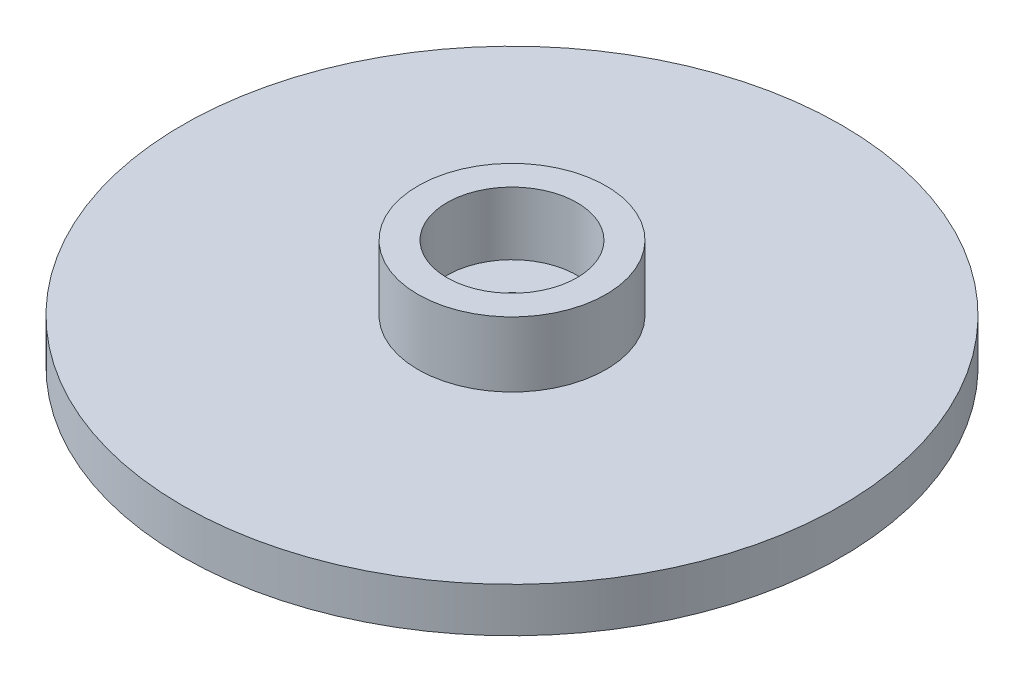
ISO-10303-21;
HEADER;
FILE_DESCRIPTION(('STEP AP214'),'2;1');
FILE_NAME('part.step','',(''),(''),'','','');
FILE_SCHEMA(('AUTOMOTIVE_DESIGN { 1 0 10303 214 1 1 1 1 }'));
ENDSEC;
DATA;
#1=APPLICATION_CONTEXT('core data for automotive mechanical design processes');
#2=APPLICATION_PROTOCOL_DEFINITION('international standard','automotive_design',2000,#1);
#3=PRODUCT_CONTEXT('',#1,'mechanical');
#4=PRODUCT('Part','Part','',(#3));
#5=PRODUCT_RELATED_PRODUCT_CATEGORY('part','',(#4));
#6=PRODUCT_DEFINITION_FORMATION('','',#4);
#7=PRODUCT_DEFINITION_CONTEXT('part definition',#1,'design');
#8=PRODUCT_DEFINITION('design','',#6,#7);
#9=PRODUCT_DEFINITION_SHAPE('','',#8);
#10=(LENGTH_UNIT() NAMED_UNIT(*) SI_UNIT(.MILLI.,.METRE.));
#11=(NAMED_UNIT(*) PLANE_ANGLE_UNIT() SI_UNIT($,.RADIAN.));
#12=(NAMED_UNIT(*) SI_UNIT($,.STERADIAN.) SOLID_ANGLE_UNIT());
#13=UNCERTAINTY_MEASURE_WITH_UNIT(LENGTH_MEASURE(1.E-05),#10,'distance_accuracy_value','');
#14=(GEOMETRIC_REPRESENTATION_CONTEXT(3) GLOBAL_UNCERTAINTY_ASSIGNED_CONTEXT((#13)) GLOBAL_UNIT_ASSIGNED_CONTEXT((#10,
#11,#12)) REPRESENTATION_CONTEXT('',''));
#15=CARTESIAN_POINT('',(0.,0.,0.));
#16=DIRECTION('',(0.,0.,1.));
#17=DIRECTION('',(1.,0.,0.));
#18=AXIS2_PLACEMENT_3D('',#15,#16,#17);
#19=CARTESIAN_POINT('',(0.,1.6764,0.));
#20=DIRECTION('',(0.,-1.,0.));
#21=DIRECTION('',(0.,0.,-1.));
#22=AXIS2_PLACEMENT_3D('',#19,#20,#21);
#23=PLANE('',#22);
#24=CARTESIAN_POINT('',(0.,1.6764,0.));
#25=DIRECTION('',(0.,1.,0.));
#26=DIRECTION('',(0.,0.,1.));
#27=AXIS2_PLACEMENT_3D('',#24,#25,#26);
#28=CIRCLE('',#27,0.889);
#29=CARTESIAN_POINT('',(0.,1.6764,0.889));
#30=VERTEX_POINT('',#29);
#31=EDGE_CURVE('E10',#30,#30,#28,.T.);
#32=ORIENTED_EDGE('',*,*,#31,.F.);
#33=EDGE_LOOP('',(#32));
#34=FACE_BOUND('',#33,.T.);
#35=CARTESIAN_POINT('',(0.,1.6764,0.));
#36=DIRECTION('',(0.,1.,0.));
#37=DIRECTION('',(0.,0.,1.));
#38=AXIS2_PLACEMENT_3D('',#35,#36,#37);
#39=CIRCLE('',#38,2.3368);
#40=CARTESIAN_POINT('',(0.,1.6764,2.3368));
#41=VERTEX_POINT('',#40);
#42=EDGE_CURVE('E78',#41,#41,#39,.T.);
#43=ORIENTED_EDGE('',*,*,#42,.T.);
#44=EDGE_LOOP('',(#43));
#45=FACE_BOUND('',#44,.T.);
#46=ADVANCED_FACE('F43',(#34,#45),#23,.F.);
#47=CARTESIAN_POINT('',(0.,1.6764,0.));
#48=DIRECTION('',(0.,1.,0.));
#49=DIRECTION('',(0.,0.,1.));
#50=AXIS2_PLACEMENT_3D('',#47,#48,#49);
#51=CYLINDRICAL_SURFACE('',#50,0.889);
#52=CARTESIAN_POINT('',(0.,0.,0.));
#53=DIRECTION('',(0.,1.,0.));
#54=DIRECTION('',(0.,0.,1.));
#55=AXIS2_PLACEMENT_3D('',#52,#53,#54);
#56=CIRCLE('',#55,0.889);
#57=CARTESIAN_POINT('',(0.,0.,0.889));
#58=VERTEX_POINT('',#57);
#59=EDGE_CURVE('E50',#58,#58,#56,.T.);
#60=ORIENTED_EDGE('',*,*,#59,.F.);
#61=EDGE_LOOP('',(#60));
#62=FACE_BOUND('',#61,.T.);
#63=ORIENTED_EDGE('',*,*,#31,.T.);
#64=EDGE_LOOP('',(#63));
#65=FACE_BOUND('',#64,.T.);
#66=ADVANCED_FACE('F116',(#62,#65),#51,.F.);
#67=CARTESIAN_POINT('',(0.,0.,0.));
#68=DIRECTION('',(0.,1.,0.));
#69=DIRECTION('',(0.,0.,1.));
#70=AXIS2_PLACEMENT_3D('',#67,#68,#69);
#71=PLANE('',#70);
#72=CARTESIAN_POINT('',(0.,0.,0.));
#73=DIRECTION('',(0.,1.,0.));
#74=DIRECTION('',(0.,0.,1.));
#75=AXIS2_PLACEMENT_3D('',#72,#73,#74);
#76=CIRCLE('',#75,11.8364);
#77=CARTESIAN_POINT('',(0.,0.,11.8364));
#78=VERTEX_POINT('',#77);
#79=EDGE_CURVE('E55',#78,#78,#76,.T.);
#80=ORIENTED_EDGE('',*,*,#79,.F.);
#81=EDGE_LOOP('',(#80));
#82=FACE_BOUND('',#81,.T.);
#83=ORIENTED_EDGE('',*,*,#59,.T.);
#84=EDGE_LOOP('',(#83));
#85=FACE_BOUND('',#84,.T.);
#86=ADVANCED_FACE('F111',(#82,#85),#71,.F.);
#87=CARTESIAN_POINT('',(0.,1.6764,0.));
#88=DIRECTION('',(0.,1.,0.));
#89=DIRECTION('',(0.,0.,1.));
#90=AXIS2_PLACEMENT_3D('',#87,#88,#89);
#91=CYLINDRICAL_SURFACE('',#90,11.8364);
#92=CARTESIAN_POINT('',(0.,1.6002,0.));
#93=DIRECTION('',(0.,1.,0.));
#94=DIRECTION('',(0.,0.,1.));
#95=AXIS2_PLACEMENT_3D('',#92,#93,#94);
#96=CIRCLE('',#95,11.8364);
#97=CARTESIAN_POINT('',(0.,1.6002,11.8364));
#98=VERTEX_POINT('',#97);
#99=EDGE_CURVE('E60',#98,#98,#96,.T.);
#100=ORIENTED_EDGE('',*,*,#99,.F.);
#101=EDGE_LOOP('',(#100));
#102=FACE_BOUND('',#101,.T.);
#103=ORIENTED_EDGE('',*,*,#79,.T.);
#104=EDGE_LOOP('',(#103));
#105=FACE_BOUND('',#104,.T.);
#106=ADVANCED_FACE('F105',(#102,#105),#91,.T.);
#107=CARTESIAN_POINT('',(0.,1.6002,0.));
#108=DIRECTION('',(0.,-1.,0.));
#109=DIRECTION('',(0.,0.,-1.));
#110=AXIS2_PLACEMENT_3D('',#107,#108,#109);
#111=PLANE('',#110);
#112=CARTESIAN_POINT('',(0.,1.6002,0.));
#113=DIRECTION('',(0.,1.,0.));
#114=DIRECTION('',(0.,0.,1.));
#115=AXIS2_PLACEMENT_3D('',#112,#113,#114);
#116=CIRCLE('',#115,3.3782);
#117=CARTESIAN_POINT('',(0.,1.6002,3.3782));
#118=VERTEX_POINT('',#117);
#119=EDGE_CURVE('E66',#118,#118,#116,.T.);
#120=ORIENTED_EDGE('',*,*,#119,.F.);
#121=EDGE_LOOP('',(#120));
#122=FACE_BOUND('',#121,.T.);
#123=ORIENTED_EDGE('',*,*,#99,.T.);
#124=EDGE_LOOP('',(#123));
#125=FACE_BOUND('',#124,.T.);
#126=ADVANCED_FACE('F99',(#122,#125),#111,.F.);
#127=CARTESIAN_POINT('',(0.,1.6764,0.));
#128=DIRECTION('',(0.,1.,0.));
#129=DIRECTION('',(0.,0.,1.));
#130=AXIS2_PLACEMENT_3D('',#127,#128,#129);
#131=CYLINDRICAL_SURFACE('',#130,3.3782);
#132=CARTESIAN_POINT('',(0.,3.937,0.));
#133=DIRECTION('',(0.,1.,0.));
#134=DIRECTION('',(0.,0.,1.));
#135=AXIS2_PLACEMENT_3D('',#132,#133,#134);
#136=CIRCLE('',#135,3.3782);
#137=CARTESIAN_POINT('',(0.,3.937,3.3782));
#138=VERTEX_POINT('',#137);
#139=EDGE_CURVE('E70',#138,#138,#136,.T.);
#140=ORIENTED_EDGE('',*,*,#139,.F.);
#141=EDGE_LOOP('',(#140));
#142=FACE_BOUND('',#141,.T.);
#143=ORIENTED_EDGE('',*,*,#119,.T.);
#144=EDGE_LOOP('',(#143));
#145=FACE_BOUND('',#144,.T.);
#146=ADVANCED_FACE('F93',(#142,#145),#131,.T.);
#147=CARTESIAN_POINT('',(0.,3.937,0.));
#148=DIRECTION('',(0.,-1.,0.));
#149=DIRECTION('',(0.,0.,-1.));
#150=AXIS2_PLACEMENT_3D('',#147,#148,#149);
#151=PLANE('',#150);
#152=CARTESIAN_POINT('',(0.,3.937,0.));
#153=DIRECTION('',(0.,1.,0.));
#154=DIRECTION('',(0.,0.,1.));
#155=AXIS2_PLACEMENT_3D('',#152,#153,#154);
#156=CIRCLE('',#155,2.3368);
#157=CARTESIAN_POINT('',(0.,3.937,2.3368));
#158=VERTEX_POINT('',#157);
#159=EDGE_CURVE('E74',#158,#158,#156,.T.);
#160=ORIENTED_EDGE('',*,*,#159,.F.);
#161=EDGE_LOOP('',(#160));
#162=FACE_BOUND('',#161,.T.);
#163=ORIENTED_EDGE('',*,*,#139,.T.);
#164=EDGE_LOOP('',(#163));
#165=FACE_BOUND('',#164,.T.);
#166=ADVANCED_FACE('F87',(#162,#165),#151,.F.);
#167=CARTESIAN_POINT('',(0.,1.6764,0.));
#168=DIRECTION('',(0.,1.,0.));
#169=DIRECTION('',(0.,0.,1.));
#170=AXIS2_PLACEMENT_3D('',#167,#168,#169);
#171=CYLINDRICAL_SURFACE('',#170,2.3368);
#172=ORIENTED_EDGE('',*,*,#42,.F.);
#173=EDGE_LOOP('',(#172));
#174=FACE_BOUND('',#173,.T.);
#175=ORIENTED_EDGE('',*,*,#159,.T.);
#176=EDGE_LOOP('',(#175));
#177=FACE_BOUND('',#176,.T.);
#178=ADVANCED_FACE('F84',(#174,#177),#171,.F.);
#179=CLOSED_SHELL('',(#46,#66,#86,#106,#126,#146,#166,#178));
#180=MANIFOLD_SOLID_BREP('B2',#179);
#181=ADVANCED_BREP_SHAPE_REPRESENTATION('',(#18,#180),#14);
#182=SHAPE_DEFINITION_REPRESENTATION(#9,#181);
ENDSEC;
END-ISO-10303-21;
